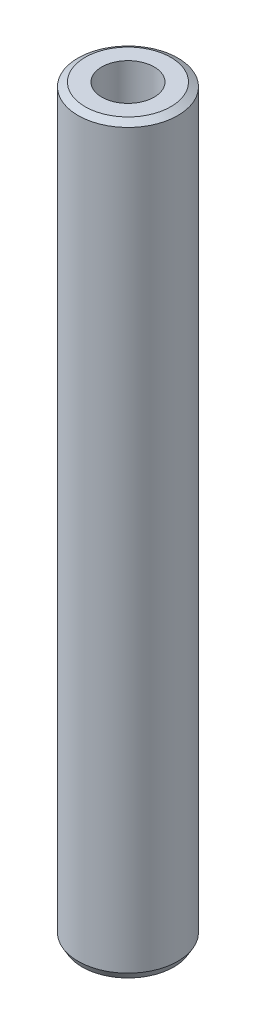
ISO-10303-21;
HEADER;
FILE_DESCRIPTION(('STEP AP214'),'2;1');
FILE_NAME('part.step','',(''),(''),'','','');
FILE_SCHEMA(('AUTOMOTIVE_DESIGN { 1 0 10303 214 1 1 1 1 }'));
ENDSEC;
DATA;
#1=APPLICATION_CONTEXT('core data for automotive mechanical design processes');
#2=APPLICATION_PROTOCOL_DEFINITION('international standard','automotive_design',2000,#1);
#3=PRODUCT_CONTEXT('',#1,'mechanical');
#4=PRODUCT('Part','Part','',(#3));
#5=PRODUCT_RELATED_PRODUCT_CATEGORY('part','',(#4));
#6=PRODUCT_DEFINITION_FORMATION('','',#4);
#7=PRODUCT_DEFINITION_CONTEXT('part definition',#1,'design');
#8=PRODUCT_DEFINITION('design','',#6,#7);
#9=PRODUCT_DEFINITION_SHAPE('','',#8);
#10=(LENGTH_UNIT() NAMED_UNIT(*) SI_UNIT(.MILLI.,.METRE.));
#11=(NAMED_UNIT(*) PLANE_ANGLE_UNIT() SI_UNIT($,.RADIAN.));
#12=(NAMED_UNIT(*) SI_UNIT($,.STERADIAN.) SOLID_ANGLE_UNIT());
#13=UNCERTAINTY_MEASURE_WITH_UNIT(LENGTH_MEASURE(1.E-05),#10,'distance_accuracy_value','');
#14=(GEOMETRIC_REPRESENTATION_CONTEXT(3) GLOBAL_UNCERTAINTY_ASSIGNED_CONTEXT((#13)) GLOBAL_UNIT_ASSIGNED_CONTEXT((#10,
#11,#12)) REPRESENTATION_CONTEXT('',''));
#15=CARTESIAN_POINT('',(0.,0.,0.));
#16=DIRECTION('',(0.,0.,1.));
#17=DIRECTION('',(1.,0.,0.));
#18=AXIS2_PLACEMENT_3D('',#15,#16,#17);
#19=CARTESIAN_POINT('',(0.,298.061542418513,0.));
#20=DIRECTION('',(0.,-1.,0.));
#21=DIRECTION('',(0.,0.,-1.));
#22=AXIS2_PLACEMENT_3D('',#19,#20,#21);
#23=CYLINDRICAL_SURFACE('',#22,20.);
#24=CARTESIAN_POINT('',(0.,296.425839336826,0.));
#25=DIRECTION('',(0.,1.,0.));
#26=DIRECTION('',(0.,0.,1.));
#27=AXIS2_PLACEMENT_3D('',#24,#25,#26);
#28=CIRCLE('',#27,20.);
#29=CARTESIAN_POINT('',(0.,296.425839336826,20.));
#30=VERTEX_POINT('',#29);
#31=EDGE_CURVE('E50',#30,#30,#28,.F.);
#32=ORIENTED_EDGE('',*,*,#31,.T.);
#33=EDGE_LOOP('',(#32));
#34=FACE_BOUND('',#33,.T.);
#35=CARTESIAN_POINT('',(0.,2.83312084357856,0.));
#36=DIRECTION('',(0.,1.,0.));
#37=DIRECTION('',(0.,0.,1.));
#38=AXIS2_PLACEMENT_3D('',#35,#36,#37);
#39=CIRCLE('',#38,20.);
#40=CARTESIAN_POINT('',(0.,2.83312084357856,20.));
#41=VERTEX_POINT('',#40);
#42=EDGE_CURVE('E51',#41,#41,#39,.T.);
#43=ORIENTED_EDGE('',*,*,#42,.T.);
#44=EDGE_LOOP('',(#43));
#45=FACE_BOUND('',#44,.T.);
#46=ADVANCED_FACE('F39',(#34,#45),#23,.T.);
#47=CARTESIAN_POINT('',(0.,298.061542418513,0.));
#48=DIRECTION('',(0.,1.,0.));
#49=DIRECTION('',(0.,0.,1.));
#50=AXIS2_PLACEMENT_3D('',#47,#48,#49);
#51=PLANE('',#50);
#52=CARTESIAN_POINT('',(0.,298.061542418513,0.));
#53=DIRECTION('',(0.,1.,0.));
#54=DIRECTION('',(0.,0.,1.));
#55=AXIS2_PLACEMENT_3D('',#52,#53,#54);
#56=CIRCLE('',#55,17.1668791564217);
#57=CARTESIAN_POINT('',(0.,298.061542418513,17.1668791564217));
#58=VERTEX_POINT('',#57);
#59=EDGE_CURVE('E54',#58,#58,#56,.T.);
#60=ORIENTED_EDGE('',*,*,#59,.T.);
#61=EDGE_LOOP('',(#60));
#62=FACE_BOUND('',#61,.T.);
#63=CARTESIAN_POINT('',(0.,298.061542418513,0.));
#64=DIRECTION('',(0.,1.,0.));
#65=DIRECTION('',(0.,0.,1.));
#66=AXIS2_PLACEMENT_3D('',#63,#64,#65);
#67=CIRCLE('',#66,10.5065158859084);
#68=CARTESIAN_POINT('',(0.,298.061542418513,10.5065158859084));
#69=VERTEX_POINT('',#68);
#70=EDGE_CURVE('E58',#69,#69,#67,.T.);
#71=ORIENTED_EDGE('',*,*,#70,.F.);
#72=EDGE_LOOP('',(#71));
#73=FACE_BOUND('',#72,.T.);
#74=ADVANCED_FACE('F69',(#62,#73),#51,.T.);
#75=CARTESIAN_POINT('',(0.,0.,0.));
#76=DIRECTION('',(0.,1.,0.));
#77=DIRECTION('',(0.,0.,1.));
#78=AXIS2_PLACEMENT_3D('',#75,#76,#77);
#79=PLANE('',#78);
#80=CARTESIAN_POINT('',(0.,0.,0.));
#81=DIRECTION('',(0.,1.,0.));
#82=DIRECTION('',(0.,0.,1.));
#83=AXIS2_PLACEMENT_3D('',#80,#81,#82);
#84=CIRCLE('',#83,18.3642969183132);
#85=CARTESIAN_POINT('',(0.,0.,18.3642969183132));
#86=VERTEX_POINT('',#85);
#87=EDGE_CURVE('E10',#86,#86,#84,.F.);
#88=ORIENTED_EDGE('',*,*,#87,.T.);
#89=EDGE_LOOP('',(#88));
#90=FACE_BOUND('',#89,.T.);
#91=CARTESIAN_POINT('',(0.,0.,0.));
#92=DIRECTION('',(0.,1.,0.));
#93=DIRECTION('',(0.,0.,1.));
#94=AXIS2_PLACEMENT_3D('',#91,#92,#93);
#95=CIRCLE('',#94,10.5065158859084);
#96=CARTESIAN_POINT('',(0.,0.,10.5065158859084));
#97=VERTEX_POINT('',#96);
#98=EDGE_CURVE('E63',#97,#97,#95,.T.);
#99=ORIENTED_EDGE('',*,*,#98,.T.);
#100=EDGE_LOOP('',(#99));
#101=FACE_BOUND('',#100,.T.);
#102=ADVANCED_FACE('F75',(#90,#101),#79,.F.);
#103=CARTESIAN_POINT('',(0.,298.061542418513,0.));
#104=DIRECTION('',(0.,-1.,0.));
#105=DIRECTION('',(0.,0.,-1.));
#106=AXIS2_PLACEMENT_3D('',#103,#104,#105);
#107=CYLINDRICAL_SURFACE('',#106,10.5065158859084);
#108=ORIENTED_EDGE('',*,*,#70,.T.);
#109=EDGE_LOOP('',(#108));
#110=FACE_BOUND('',#109,.T.);
#111=ORIENTED_EDGE('',*,*,#98,.F.);
#112=EDGE_LOOP('',(#111));
#113=FACE_BOUND('',#112,.T.);
#114=ADVANCED_FACE('F70',(#110,#113),#107,.F.);
#115=CARTESIAN_POINT('',(0.,298.061542418513,0.));
#116=DIRECTION('',(0.,-1.,0.));
#117=DIRECTION('',(0.,0.,-1.));
#118=AXIS2_PLACEMENT_3D('',#115,#116,#117);
#119=CONICAL_SURFACE('',#118,17.1668791564217,1.04719755119659);
#120=ORIENTED_EDGE('',*,*,#31,.F.);
#121=EDGE_LOOP('',(#120));
#122=FACE_BOUND('',#121,.T.);
#123=ORIENTED_EDGE('',*,*,#59,.F.);
#124=EDGE_LOOP('',(#123));
#125=FACE_BOUND('',#124,.T.);
#126=ADVANCED_FACE('F81',(#122,#125),#119,.T.);
#127=CARTESIAN_POINT('',(0.,2.83312084357856,0.));
#128=DIRECTION('',(0.,1.,0.));
#129=DIRECTION('',(0.,0.,1.));
#130=AXIS2_PLACEMENT_3D('',#127,#128,#129);
#131=CONICAL_SURFACE('',#130,20.,0.523598775598299);
#132=ORIENTED_EDGE('',*,*,#87,.F.);
#133=EDGE_LOOP('',(#132));
#134=FACE_BOUND('',#133,.T.);
#135=ORIENTED_EDGE('',*,*,#42,.F.);
#136=EDGE_LOOP('',(#135));
#137=FACE_BOUND('',#136,.T.);
#138=ADVANCED_FACE('F45',(#134,#137),#131,.T.);
#139=CLOSED_SHELL('',(#46,#74,#102,#114,#126,#138));
#140=MANIFOLD_SOLID_BREP('B2',#139);
#141=ADVANCED_BREP_SHAPE_REPRESENTATION('',(#18,#140),#14);
#142=SHAPE_DEFINITION_REPRESENTATION(#9,#141);
ENDSEC;
END-ISO-10303-21;
